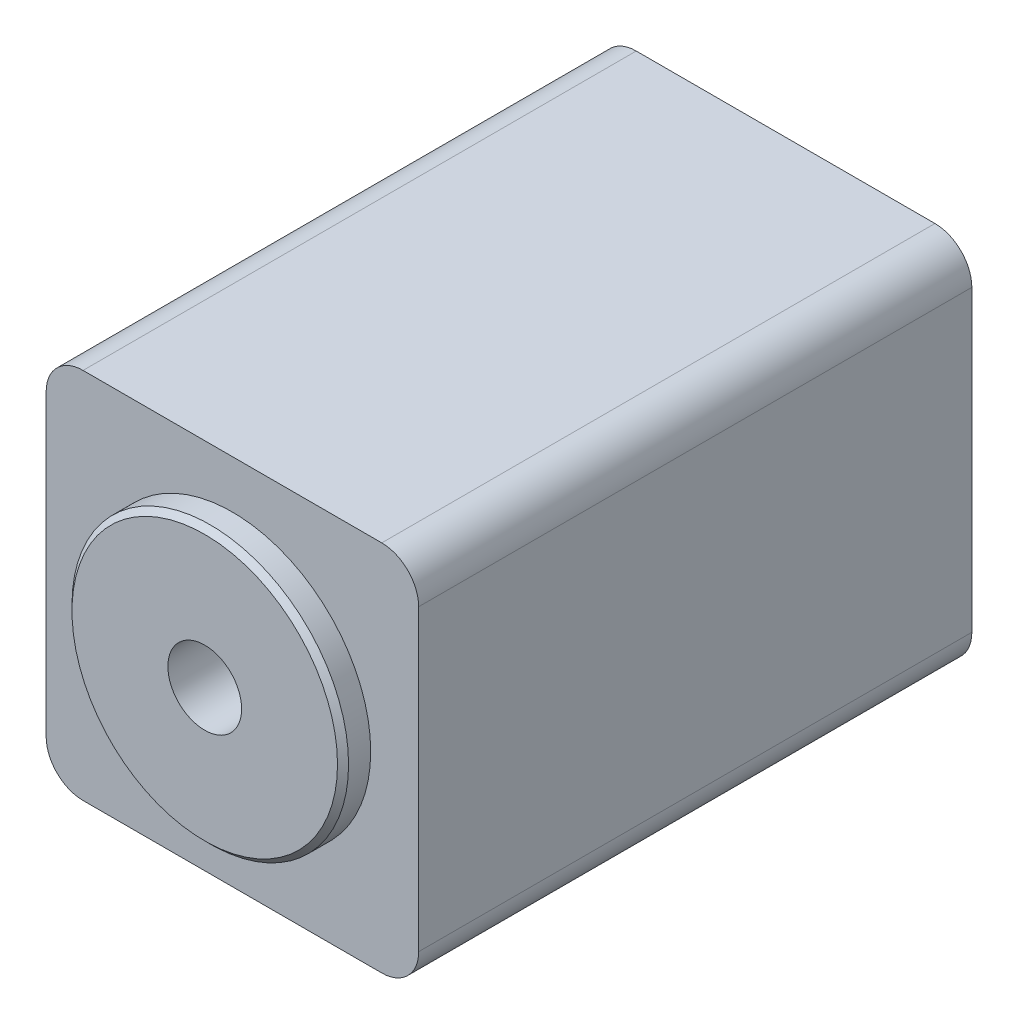
ISO-10303-21;
HEADER;
FILE_DESCRIPTION(('STEP AP214'),'2;1');
FILE_NAME('part.step','',(''),(''),'','','');
FILE_SCHEMA(('AUTOMOTIVE_DESIGN { 1 0 10303 214 1 1 1 1 }'));
ENDSEC;
DATA;
#1=APPLICATION_CONTEXT('core data for automotive mechanical design processes');
#2=APPLICATION_PROTOCOL_DEFINITION('international standard','automotive_design',2000,#1);
#3=PRODUCT_CONTEXT('',#1,'mechanical');
#4=PRODUCT('Part','Part','',(#3));
#5=PRODUCT_RELATED_PRODUCT_CATEGORY('part','',(#4));
#6=PRODUCT_DEFINITION_FORMATION('','',#4);
#7=PRODUCT_DEFINITION_CONTEXT('part definition',#1,'design');
#8=PRODUCT_DEFINITION('design','',#6,#7);
#9=PRODUCT_DEFINITION_SHAPE('','',#8);
#10=(LENGTH_UNIT() NAMED_UNIT(*) SI_UNIT(.MILLI.,.METRE.));
#11=(NAMED_UNIT(*) PLANE_ANGLE_UNIT() SI_UNIT($,.RADIAN.));
#12=(NAMED_UNIT(*) SI_UNIT($,.STERADIAN.) SOLID_ANGLE_UNIT());
#13=UNCERTAINTY_MEASURE_WITH_UNIT(LENGTH_MEASURE(1.E-05),#10,'distance_accuracy_value','');
#14=(GEOMETRIC_REPRESENTATION_CONTEXT(3) GLOBAL_UNCERTAINTY_ASSIGNED_CONTEXT((#13)) GLOBAL_UNIT_ASSIGNED_CONTEXT((#10,
#11,#12)) REPRESENTATION_CONTEXT('',''));
#15=CARTESIAN_POINT('',(0.,0.,0.));
#16=DIRECTION('',(0.,0.,1.));
#17=DIRECTION('',(1.,0.,0.));
#18=AXIS2_PLACEMENT_3D('',#15,#16,#17);
#19=CARTESIAN_POINT('',(0.,0.,1.5));
#20=DIRECTION('',(0.,0.,-1.));
#21=DIRECTION('',(-1.,0.,0.));
#22=AXIS2_PLACEMENT_3D('',#19,#20,#21);
#23=CYLINDRICAL_SURFACE('',#22,7.5);
#24=CARTESIAN_POINT('',(0.,0.,1.2));
#25=DIRECTION('',(0.,0.,1.));
#26=DIRECTION('',(1.,0.,0.));
#27=AXIS2_PLACEMENT_3D('',#24,#25,#26);
#28=CIRCLE('',#27,7.5);
#29=CARTESIAN_POINT('',(7.5,0.,1.2));
#30=VERTEX_POINT('',#29);
#31=EDGE_CURVE('E152',#30,#30,#28,.F.);
#32=ORIENTED_EDGE('',*,*,#31,.T.);
#33=EDGE_LOOP('',(#32));
#34=FACE_BOUND('',#33,.T.);
#35=CARTESIAN_POINT('',(0.,0.,0.));
#36=DIRECTION('',(0.,0.,-1.));
#37=DIRECTION('',(-1.,0.,0.));
#38=AXIS2_PLACEMENT_3D('',#35,#36,#37);
#39=CIRCLE('',#38,7.5);
#40=CARTESIAN_POINT('',(-7.5,0.,0.));
#41=VERTEX_POINT('',#40);
#42=EDGE_CURVE('E146',#41,#41,#39,.T.);
#43=ORIENTED_EDGE('',*,*,#42,.F.);
#44=EDGE_LOOP('',(#43));
#45=FACE_BOUND('',#44,.T.);
#46=ADVANCED_FACE('F36',(#34,#45),#23,.T.);
#47=CARTESIAN_POINT('',(0.,0.,1.5));
#48=DIRECTION('',(0.,0.,1.));
#49=DIRECTION('',(1.,0.,0.));
#50=AXIS2_PLACEMENT_3D('',#47,#48,#49);
#51=PLANE('',#50);
#52=CARTESIAN_POINT('',(0.,0.,1.5));
#53=DIRECTION('',(0.,0.,1.));
#54=DIRECTION('',(1.,0.,0.));
#55=AXIS2_PLACEMENT_3D('',#52,#53,#54);
#56=CIRCLE('',#55,7.2);
#57=CARTESIAN_POINT('',(7.2,0.,1.5));
#58=VERTEX_POINT('',#57);
#59=EDGE_CURVE('E149',#58,#58,#56,.T.);
#60=ORIENTED_EDGE('',*,*,#59,.T.);
#61=EDGE_LOOP('',(#60));
#62=FACE_BOUND('',#61,.T.);
#63=CARTESIAN_POINT('',(0.,0.,1.5));
#64=DIRECTION('',(0.,0.,1.));
#65=DIRECTION('',(1.,0.,0.));
#66=AXIS2_PLACEMENT_3D('',#63,#64,#65);
#67=CIRCLE('',#66,2.);
#68=CARTESIAN_POINT('',(2.,0.,1.5));
#69=VERTEX_POINT('',#68);
#70=EDGE_CURVE('E137',#69,#69,#67,.T.);
#71=ORIENTED_EDGE('',*,*,#70,.F.);
#72=EDGE_LOOP('',(#71));
#73=FACE_BOUND('',#72,.T.);
#74=ADVANCED_FACE('F201',(#62,#73),#51,.T.);
#75=CARTESIAN_POINT('',(-10.1,10.1,-30.));
#76=DIRECTION('',(1.,0.,0.));
#77=DIRECTION('',(0.,1.,0.));
#78=AXIS2_PLACEMENT_3D('',#75,#76,#77);
#79=PLANE('',#78);
#80=DIRECTION('',(0.,1.,0.));
#81=VECTOR('',#80,1.);
#82=CARTESIAN_POINT('',(-10.1,10.1,-30.));
#83=LINE('',#82,#81);
#84=CARTESIAN_POINT('',(-10.1,-8.1,-30.));
#85=VERTEX_POINT('',#84);
#86=CARTESIAN_POINT('',(-10.1,8.1,-30.));
#87=VERTEX_POINT('',#86);
#88=EDGE_CURVE('E123',#85,#87,#83,.T.);
#89=ORIENTED_EDGE('',*,*,#88,.F.);
#90=DIRECTION('',(0.,0.,1.));
#91=VECTOR('',#90,1.);
#92=CARTESIAN_POINT('',(-10.1,-8.1,-30.));
#93=LINE('',#92,#91);
#94=CARTESIAN_POINT('',(-10.1,-8.1,0.));
#95=VERTEX_POINT('',#94);
#96=EDGE_CURVE('E107',#85,#95,#93,.T.);
#97=ORIENTED_EDGE('',*,*,#96,.T.);
#98=DIRECTION('',(0.,1.,0.));
#99=VECTOR('',#98,1.);
#100=CARTESIAN_POINT('',(-10.1,10.1,0.));
#101=LINE('',#100,#99);
#102=CARTESIAN_POINT('',(-10.1,8.1,0.));
#103=VERTEX_POINT('',#102);
#104=EDGE_CURVE('E120',#95,#103,#101,.T.);
#105=ORIENTED_EDGE('',*,*,#104,.T.);
#106=DIRECTION('',(0.,0.,1.));
#107=VECTOR('',#106,1.);
#108=CARTESIAN_POINT('',(-10.1,8.1,-30.));
#109=LINE('',#108,#107);
#110=EDGE_CURVE('E125',#103,#87,#109,.F.);
#111=ORIENTED_EDGE('',*,*,#110,.T.);
#112=EDGE_LOOP('',(#89,#97,#105,#111));
#113=FACE_BOUND('',#112,.T.);
#114=ADVANCED_FACE('F119',(#113),#79,.F.);
#115=CARTESIAN_POINT('',(10.1,10.1,-30.));
#116=DIRECTION('',(0.,-1.,0.));
#117=DIRECTION('',(0.,0.,-1.));
#118=AXIS2_PLACEMENT_3D('',#115,#116,#117);
#119=PLANE('',#118);
#120=DIRECTION('',(1.,0.,0.));
#121=VECTOR('',#120,1.);
#122=CARTESIAN_POINT('',(10.1,10.1,-30.));
#123=LINE('',#122,#121);
#124=CARTESIAN_POINT('',(-8.1,10.1,-30.));
#125=VERTEX_POINT('',#124);
#126=CARTESIAN_POINT('',(8.1,10.1,-30.));
#127=VERTEX_POINT('',#126);
#128=EDGE_CURVE('E176',#125,#127,#123,.T.);
#129=ORIENTED_EDGE('',*,*,#128,.F.);
#130=DIRECTION('',(0.,0.,1.));
#131=VECTOR('',#130,1.);
#132=CARTESIAN_POINT('',(-8.1,10.1,-30.));
#133=LINE('',#132,#131);
#134=CARTESIAN_POINT('',(-8.1,10.1,0.));
#135=VERTEX_POINT('',#134);
#136=EDGE_CURVE('E11',#125,#135,#133,.T.);
#137=ORIENTED_EDGE('',*,*,#136,.T.);
#138=DIRECTION('',(1.,0.,0.));
#139=VECTOR('',#138,1.);
#140=CARTESIAN_POINT('',(10.1,10.1,0.));
#141=LINE('',#140,#139);
#142=CARTESIAN_POINT('',(8.1,10.1,0.));
#143=VERTEX_POINT('',#142);
#144=EDGE_CURVE('E130',#135,#143,#141,.T.);
#145=ORIENTED_EDGE('',*,*,#144,.T.);
#146=DIRECTION('',(0.,0.,1.));
#147=VECTOR('',#146,1.);
#148=CARTESIAN_POINT('',(8.1,10.1,-30.));
#149=LINE('',#148,#147);
#150=EDGE_CURVE('E44',#143,#127,#149,.F.);
#151=ORIENTED_EDGE('',*,*,#150,.T.);
#152=EDGE_LOOP('',(#129,#137,#145,#151));
#153=FACE_BOUND('',#152,.T.);
#154=ADVANCED_FACE('F175',(#153),#119,.F.);
#155=CARTESIAN_POINT('',(10.1,10.1,-30.));
#156=DIRECTION('',(-1.,0.,0.));
#157=DIRECTION('',(0.,-1.,0.));
#158=AXIS2_PLACEMENT_3D('',#155,#156,#157);
#159=PLANE('',#158);
#160=DIRECTION('',(0.,-1.,0.));
#161=VECTOR('',#160,1.);
#162=CARTESIAN_POINT('',(10.1,10.1,0.));
#163=LINE('',#162,#161);
#164=CARTESIAN_POINT('',(10.1,8.1,0.));
#165=VERTEX_POINT('',#164);
#166=CARTESIAN_POINT('',(10.1,-8.1,0.));
#167=VERTEX_POINT('',#166);
#168=EDGE_CURVE('E134',#165,#167,#163,.T.);
#169=ORIENTED_EDGE('',*,*,#168,.T.);
#170=DIRECTION('',(0.,0.,1.));
#171=VECTOR('',#170,1.);
#172=CARTESIAN_POINT('',(10.1,-8.1,-30.));
#173=LINE('',#172,#171);
#174=CARTESIAN_POINT('',(10.1,-8.1,-30.));
#175=VERTEX_POINT('',#174);
#176=EDGE_CURVE('E51',#167,#175,#173,.F.);
#177=ORIENTED_EDGE('',*,*,#176,.T.);
#178=DIRECTION('',(0.,-1.,0.));
#179=VECTOR('',#178,1.);
#180=CARTESIAN_POINT('',(10.1,10.1,-30.));
#181=LINE('',#180,#179);
#182=CARTESIAN_POINT('',(10.1,8.1,-30.));
#183=VERTEX_POINT('',#182);
#184=EDGE_CURVE('E182',#183,#175,#181,.T.);
#185=ORIENTED_EDGE('',*,*,#184,.F.);
#186=DIRECTION('',(0.,0.,1.));
#187=VECTOR('',#186,1.);
#188=CARTESIAN_POINT('',(10.1,8.1,-30.));
#189=LINE('',#188,#187);
#190=EDGE_CURVE('E169',#183,#165,#189,.T.);
#191=ORIENTED_EDGE('',*,*,#190,.T.);
#192=EDGE_LOOP('',(#169,#177,#185,#191));
#193=FACE_BOUND('',#192,.T.);
#194=ADVANCED_FACE('F186',(#193),#159,.F.);
#195=CARTESIAN_POINT('',(10.1,-10.1,-30.));
#196=DIRECTION('',(0.,1.,0.));
#197=DIRECTION('',(0.,0.,1.));
#198=AXIS2_PLACEMENT_3D('',#195,#196,#197);
#199=PLANE('',#198);
#200=DIRECTION('',(-1.,0.,0.));
#201=VECTOR('',#200,1.);
#202=CARTESIAN_POINT('',(10.1,-10.1,0.));
#203=LINE('',#202,#201);
#204=CARTESIAN_POINT('',(8.1,-10.1,0.));
#205=VERTEX_POINT('',#204);
#206=CARTESIAN_POINT('',(-8.1,-10.1,0.));
#207=VERTEX_POINT('',#206);
#208=EDGE_CURVE('E144',#205,#207,#203,.T.);
#209=ORIENTED_EDGE('',*,*,#208,.T.);
#210=DIRECTION('',(0.,0.,1.));
#211=VECTOR('',#210,1.);
#212=CARTESIAN_POINT('',(-8.1,-10.1,-30.));
#213=LINE('',#212,#211);
#214=CARTESIAN_POINT('',(-8.1,-10.1,-30.));
#215=VERTEX_POINT('',#214);
#216=EDGE_CURVE('E108',#207,#215,#213,.F.);
#217=ORIENTED_EDGE('',*,*,#216,.T.);
#218=DIRECTION('',(-1.,0.,0.));
#219=VECTOR('',#218,1.);
#220=CARTESIAN_POINT('',(10.1,-10.1,-30.));
#221=LINE('',#220,#219);
#222=CARTESIAN_POINT('',(8.1,-10.1,-30.));
#223=VERTEX_POINT('',#222);
#224=EDGE_CURVE('E140',#223,#215,#221,.T.);
#225=ORIENTED_EDGE('',*,*,#224,.F.);
#226=DIRECTION('',(0.,0.,1.));
#227=VECTOR('',#226,1.);
#228=CARTESIAN_POINT('',(8.1,-10.1,-30.));
#229=LINE('',#228,#227);
#230=EDGE_CURVE('E113',#223,#205,#229,.T.);
#231=ORIENTED_EDGE('',*,*,#230,.T.);
#232=EDGE_LOOP('',(#209,#217,#225,#231));
#233=FACE_BOUND('',#232,.T.);
#234=ADVANCED_FACE('F193',(#233),#199,.F.);
#235=CARTESIAN_POINT('',(0.,0.,-30.));
#236=DIRECTION('',(0.,0.,-1.));
#237=DIRECTION('',(-1.,0.,0.));
#238=AXIS2_PLACEMENT_3D('',#235,#236,#237);
#239=PLANE('',#238);
#240=ORIENTED_EDGE('',*,*,#224,.T.);
#241=CARTESIAN_POINT('',(-8.1,-8.1,-30.));
#242=DIRECTION('',(0.,0.,-1.));
#243=DIRECTION('',(-1.,0.,0.));
#244=AXIS2_PLACEMENT_3D('',#241,#242,#243);
#245=CIRCLE('',#244,2.);
#246=EDGE_CURVE('E167',#215,#85,#245,.T.);
#247=ORIENTED_EDGE('',*,*,#246,.T.);
#248=ORIENTED_EDGE('',*,*,#88,.T.);
#249=CARTESIAN_POINT('',(-8.1,8.1,-30.));
#250=DIRECTION('',(0.,0.,-1.));
#251=DIRECTION('',(-1.,0.,0.));
#252=AXIS2_PLACEMENT_3D('',#249,#250,#251);
#253=CIRCLE('',#252,2.);
#254=EDGE_CURVE('E163',#87,#125,#253,.T.);
#255=ORIENTED_EDGE('',*,*,#254,.T.);
#256=ORIENTED_EDGE('',*,*,#128,.T.);
#257=CARTESIAN_POINT('',(8.1,8.1,-30.));
#258=DIRECTION('',(0.,0.,-1.));
#259=DIRECTION('',(-1.,0.,0.));
#260=AXIS2_PLACEMENT_3D('',#257,#258,#259);
#261=CIRCLE('',#260,2.);
#262=EDGE_CURVE('E58',#127,#183,#261,.T.);
#263=ORIENTED_EDGE('',*,*,#262,.T.);
#264=ORIENTED_EDGE('',*,*,#184,.T.);
#265=CARTESIAN_POINT('',(8.1,-8.1,-30.));
#266=DIRECTION('',(0.,0.,-1.));
#267=DIRECTION('',(-1.,0.,0.));
#268=AXIS2_PLACEMENT_3D('',#265,#266,#267);
#269=CIRCLE('',#268,2.);
#270=EDGE_CURVE('E165',#175,#223,#269,.T.);
#271=ORIENTED_EDGE('',*,*,#270,.T.);
#272=EDGE_LOOP('',(#240,#247,#248,#255,#256,#263,#264,#271));
#273=FACE_BOUND('',#272,.T.);
#274=ADVANCED_FACE('F180',(#273),#239,.T.);
#275=CARTESIAN_POINT('',(0.,0.,0.));
#276=DIRECTION('',(0.,0.,-1.));
#277=DIRECTION('',(-1.,0.,0.));
#278=AXIS2_PLACEMENT_3D('',#275,#276,#277);
#279=PLANE('',#278);
#280=ORIENTED_EDGE('',*,*,#42,.T.);
#281=EDGE_LOOP('',(#280));
#282=FACE_BOUND('',#281,.T.);
#283=ORIENTED_EDGE('',*,*,#104,.F.);
#284=CARTESIAN_POINT('',(-8.1,-8.1,0.));
#285=DIRECTION('',(0.,0.,-1.));
#286=DIRECTION('',(-1.,0.,0.));
#287=AXIS2_PLACEMENT_3D('',#284,#285,#286);
#288=CIRCLE('',#287,2.);
#289=EDGE_CURVE('E103',#95,#207,#288,.F.);
#290=ORIENTED_EDGE('',*,*,#289,.T.);
#291=ORIENTED_EDGE('',*,*,#208,.F.);
#292=CARTESIAN_POINT('',(8.1,-8.1,0.));
#293=DIRECTION('',(0.,0.,-1.));
#294=DIRECTION('',(-1.,0.,0.));
#295=AXIS2_PLACEMENT_3D('',#292,#293,#294);
#296=CIRCLE('',#295,2.);
#297=EDGE_CURVE('E114',#205,#167,#296,.F.);
#298=ORIENTED_EDGE('',*,*,#297,.T.);
#299=ORIENTED_EDGE('',*,*,#168,.F.);
#300=CARTESIAN_POINT('',(8.1,8.1,0.));
#301=DIRECTION('',(0.,0.,-1.));
#302=DIRECTION('',(-1.,0.,0.));
#303=AXIS2_PLACEMENT_3D('',#300,#301,#302);
#304=CIRCLE('',#303,2.);
#305=EDGE_CURVE('E124',#165,#143,#304,.F.);
#306=ORIENTED_EDGE('',*,*,#305,.T.);
#307=ORIENTED_EDGE('',*,*,#144,.F.);
#308=CARTESIAN_POINT('',(-8.1,8.1,0.));
#309=DIRECTION('',(0.,0.,-1.));
#310=DIRECTION('',(-1.,0.,0.));
#311=AXIS2_PLACEMENT_3D('',#308,#309,#310);
#312=CIRCLE('',#311,2.);
#313=EDGE_CURVE('E129',#135,#103,#312,.F.);
#314=ORIENTED_EDGE('',*,*,#313,.T.);
#315=EDGE_LOOP('',(#283,#290,#291,#298,#299,#306,#307,#314));
#316=FACE_BOUND('',#315,.T.);
#317=ADVANCED_FACE('F127',(#282,#316),#279,.F.);
#318=CARTESIAN_POINT('',(0.,0.,-8.5));
#319=DIRECTION('',(0.,0.,1.));
#320=DIRECTION('',(1.,0.,0.));
#321=AXIS2_PLACEMENT_3D('',#318,#319,#320);
#322=CYLINDRICAL_SURFACE('',#321,2.);
#323=CARTESIAN_POINT('',(0.,0.,-8.5));
#324=DIRECTION('',(0.,0.,1.));
#325=DIRECTION('',(1.,0.,0.));
#326=AXIS2_PLACEMENT_3D('',#323,#324,#325);
#327=CIRCLE('',#326,2.);
#328=CARTESIAN_POINT('',(2.,0.,-8.5));
#329=VERTEX_POINT('',#328);
#330=EDGE_CURVE('E131',#329,#329,#327,.T.);
#331=ORIENTED_EDGE('',*,*,#330,.F.);
#332=EDGE_LOOP('',(#331));
#333=FACE_BOUND('',#332,.T.);
#334=ORIENTED_EDGE('',*,*,#70,.T.);
#335=EDGE_LOOP('',(#334));
#336=FACE_BOUND('',#335,.T.);
#337=ADVANCED_FACE('F199',(#333,#336),#322,.F.);
#338=CARTESIAN_POINT('',(0.,0.,-8.5));
#339=DIRECTION('',(0.,0.,1.));
#340=DIRECTION('',(1.,0.,0.));
#341=AXIS2_PLACEMENT_3D('',#338,#339,#340);
#342=PLANE('',#341);
#343=ORIENTED_EDGE('',*,*,#330,.T.);
#344=EDGE_LOOP('',(#343));
#345=FACE_BOUND('',#344,.T.);
#346=ADVANCED_FACE('F217',(#345),#342,.T.);
#347=CARTESIAN_POINT('',(0.,0.,1.5));
#348=DIRECTION('',(0.,0.,-1.));
#349=DIRECTION('',(-1.,0.,0.));
#350=AXIS2_PLACEMENT_3D('',#347,#348,#349);
#351=CONICAL_SURFACE('',#350,7.2,0.785398163397444);
#352=ORIENTED_EDGE('',*,*,#31,.F.);
#353=EDGE_LOOP('',(#352));
#354=FACE_BOUND('',#353,.T.);
#355=ORIENTED_EDGE('',*,*,#59,.F.);
#356=EDGE_LOOP('',(#355));
#357=FACE_BOUND('',#356,.T.);
#358=ADVANCED_FACE('F214',(#354,#357),#351,.T.);
#359=CARTESIAN_POINT('',(-8.1,-8.1,-30.));
#360=DIRECTION('',(0.,0.,1.));
#361=DIRECTION('',(1.,0.,0.));
#362=AXIS2_PLACEMENT_3D('',#359,#360,#361);
#363=CYLINDRICAL_SURFACE('',#362,2.);
#364=ORIENTED_EDGE('',*,*,#246,.F.);
#365=ORIENTED_EDGE('',*,*,#216,.F.);
#366=ORIENTED_EDGE('',*,*,#289,.F.);
#367=ORIENTED_EDGE('',*,*,#96,.F.);
#368=EDGE_LOOP('',(#364,#365,#366,#367));
#369=FACE_BOUND('',#368,.T.);
#370=ADVANCED_FACE('F106',(#369),#363,.T.);
#371=CARTESIAN_POINT('',(8.1,-8.1,-30.));
#372=DIRECTION('',(0.,0.,1.));
#373=DIRECTION('',(1.,0.,0.));
#374=AXIS2_PLACEMENT_3D('',#371,#372,#373);
#375=CYLINDRICAL_SURFACE('',#374,2.);
#376=ORIENTED_EDGE('',*,*,#270,.F.);
#377=ORIENTED_EDGE('',*,*,#176,.F.);
#378=ORIENTED_EDGE('',*,*,#297,.F.);
#379=ORIENTED_EDGE('',*,*,#230,.F.);
#380=EDGE_LOOP('',(#376,#377,#378,#379));
#381=FACE_BOUND('',#380,.T.);
#382=ADVANCED_FACE('F190',(#381),#375,.T.);
#383=CARTESIAN_POINT('',(-8.1,8.1,-30.));
#384=DIRECTION('',(0.,0.,1.));
#385=DIRECTION('',(1.,0.,0.));
#386=AXIS2_PLACEMENT_3D('',#383,#384,#385);
#387=CYLINDRICAL_SURFACE('',#386,2.);
#388=ORIENTED_EDGE('',*,*,#254,.F.);
#389=ORIENTED_EDGE('',*,*,#110,.F.);
#390=ORIENTED_EDGE('',*,*,#313,.F.);
#391=ORIENTED_EDGE('',*,*,#136,.F.);
#392=EDGE_LOOP('',(#388,#389,#390,#391));
#393=FACE_BOUND('',#392,.T.);
#394=ADVANCED_FACE('F222',(#393),#387,.T.);
#395=CARTESIAN_POINT('',(8.1,8.1,-30.));
#396=DIRECTION('',(0.,0.,1.));
#397=DIRECTION('',(1.,0.,0.));
#398=AXIS2_PLACEMENT_3D('',#395,#396,#397);
#399=CYLINDRICAL_SURFACE('',#398,2.);
#400=ORIENTED_EDGE('',*,*,#262,.F.);
#401=ORIENTED_EDGE('',*,*,#150,.F.);
#402=ORIENTED_EDGE('',*,*,#305,.F.);
#403=ORIENTED_EDGE('',*,*,#190,.F.);
#404=EDGE_LOOP('',(#400,#401,#402,#403));
#405=FACE_BOUND('',#404,.T.);
#406=ADVANCED_FACE('F38',(#405),#399,.T.);
#407=CLOSED_SHELL('',(#46,#74,#114,#154,#194,#234,#274,#317,#337,#346,#358,#370,#382,#394,#406));
#408=MANIFOLD_SOLID_BREP('B2',#407);
#409=ADVANCED_BREP_SHAPE_REPRESENTATION('',(#18,#408),#14);
#410=SHAPE_DEFINITION_REPRESENTATION(#9,#409);
ENDSEC;
END-ISO-10303-21;
